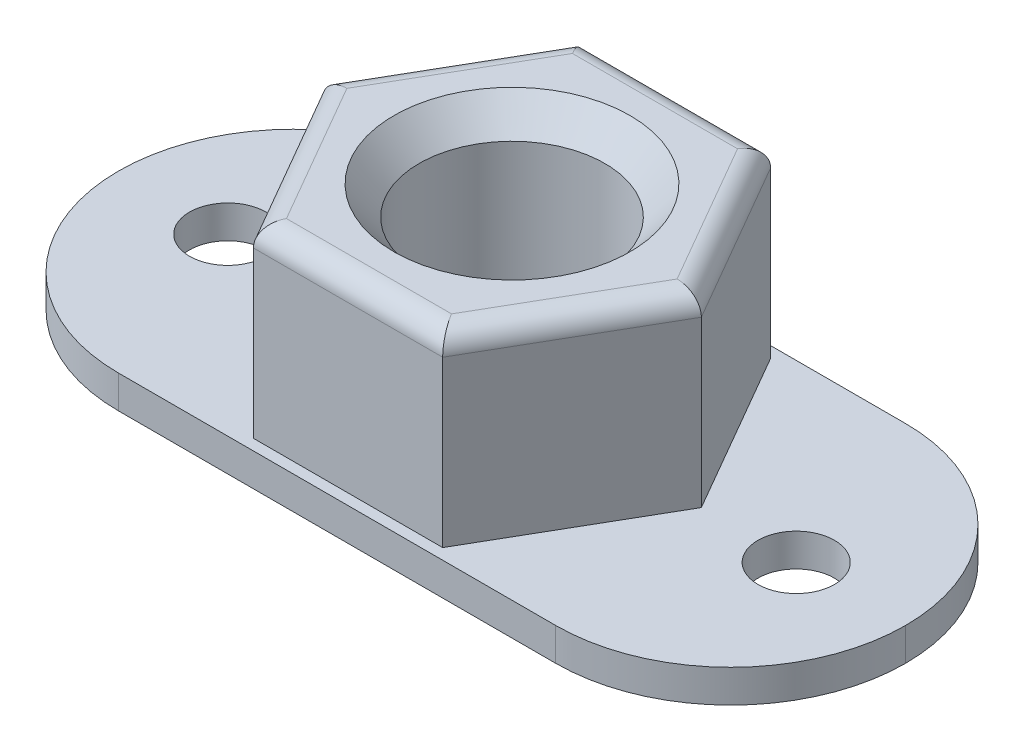
ISO-10303-21;
HEADER;
FILE_DESCRIPTION(('STEP AP214'),'2;1');
FILE_NAME('part.step','',(''),(''),'','','');
FILE_SCHEMA(('AUTOMOTIVE_DESIGN { 1 0 10303 214 1 1 1 1 }'));
ENDSEC;
DATA;
#1=APPLICATION_CONTEXT('core data for automotive mechanical design processes');
#2=APPLICATION_PROTOCOL_DEFINITION('international standard','automotive_design',2000,#1);
#3=PRODUCT_CONTEXT('',#1,'mechanical');
#4=PRODUCT('Part','Part','',(#3));
#5=PRODUCT_RELATED_PRODUCT_CATEGORY('part','',(#4));
#6=PRODUCT_DEFINITION_FORMATION('','',#4);
#7=PRODUCT_DEFINITION_CONTEXT('part definition',#1,'design');
#8=PRODUCT_DEFINITION('design','',#6,#7);
#9=PRODUCT_DEFINITION_SHAPE('','',#8);
#10=(LENGTH_UNIT() NAMED_UNIT(*) SI_UNIT(.MILLI.,.METRE.));
#11=(NAMED_UNIT(*) PLANE_ANGLE_UNIT() SI_UNIT($,.RADIAN.));
#12=(NAMED_UNIT(*) SI_UNIT($,.STERADIAN.) SOLID_ANGLE_UNIT());
#13=UNCERTAINTY_MEASURE_WITH_UNIT(LENGTH_MEASURE(1.E-05),#10,'distance_accuracy_value','');
#14=(GEOMETRIC_REPRESENTATION_CONTEXT(3) GLOBAL_UNCERTAINTY_ASSIGNED_CONTEXT((#13)) GLOBAL_UNIT_ASSIGNED_CONTEXT((#10,
#11,#12)) REPRESENTATION_CONTEXT('',''));
#15=CARTESIAN_POINT('',(0.,0.,0.));
#16=DIRECTION('',(0.,0.,1.));
#17=DIRECTION('',(1.,0.,0.));
#18=AXIS2_PLACEMENT_3D('',#15,#16,#17);
#19=CARTESIAN_POINT('',(6.87407664253899,13.49375,11.90625));
#20=DIRECTION('',(-0.866025403784438,0.,-0.5));
#21=DIRECTION('',(-0.5,0.,0.866025403784439));
#22=AXIS2_PLACEMENT_3D('',#19,#20,#21);
#23=PLANE('',#22);
#24=DIRECTION('',(0.,-1.,0.));
#25=VECTOR('',#24,1.);
#26=CARTESIAN_POINT('',(13.748153285078,13.49375,0.));
#27=LINE('',#26,#25);
#28=CARTESIAN_POINT('',(13.748153285078,11.96975,0.));
#29=VERTEX_POINT('',#28);
#30=CARTESIAN_POINT('',(13.748153285078,0.,0.));
#31=VERTEX_POINT('',#30);
#32=EDGE_CURVE('E156',#29,#31,#27,.T.);
#33=ORIENTED_EDGE('',*,*,#32,.F.);
#34=DIRECTION('',(0.5,0.,-0.866025403784439));
#35=VECTOR('',#34,1.);
#36=CARTESIAN_POINT('',(6.87407664253899,11.96975,11.90625));
#37=LINE('',#36,#35);
#38=CARTESIAN_POINT('',(6.87407664253899,11.96975,11.90625));
#39=VERTEX_POINT('',#38);
#40=EDGE_CURVE('E212',#29,#39,#37,.F.);
#41=ORIENTED_EDGE('',*,*,#40,.T.);
#42=DIRECTION('',(0.,-1.,0.));
#43=VECTOR('',#42,1.);
#44=CARTESIAN_POINT('',(6.87407664253899,13.49375,11.90625));
#45=LINE('',#44,#43);
#46=CARTESIAN_POINT('',(6.87407664253899,0.,11.90625));
#47=VERTEX_POINT('',#46);
#48=EDGE_CURVE('E166',#39,#47,#45,.T.);
#49=ORIENTED_EDGE('',*,*,#48,.T.);
#50=DIRECTION('',(0.5,0.,-0.866025403784438));
#51=VECTOR('',#50,1.);
#52=CARTESIAN_POINT('',(6.87407664253899,0.,11.90625));
#53=LINE('',#52,#51);
#54=EDGE_CURVE('E147',#47,#31,#53,.T.);
#55=ORIENTED_EDGE('',*,*,#54,.T.);
#56=EDGE_LOOP('',(#33,#41,#49,#55));
#57=FACE_BOUND('',#56,.T.);
#58=ADVANCED_FACE('F35',(#57),#23,.F.);
#59=CARTESIAN_POINT('',(13.748153285078,13.49375,0.));
#60=DIRECTION('',(-0.866025403784438,0.,0.5));
#61=DIRECTION('',(0.5,0.,0.866025403784439));
#62=AXIS2_PLACEMENT_3D('',#59,#60,#61);
#63=PLANE('',#62);
#64=DIRECTION('',(0.,-1.,0.));
#65=VECTOR('',#64,1.);
#66=CARTESIAN_POINT('',(6.87407664253898,13.49375,-11.90625));
#67=LINE('',#66,#65);
#68=CARTESIAN_POINT('',(6.87407664253898,11.96975,-11.90625));
#69=VERTEX_POINT('',#68);
#70=CARTESIAN_POINT('',(6.87407664253898,0.,-11.90625));
#71=VERTEX_POINT('',#70);
#72=EDGE_CURVE('E163',#69,#71,#67,.T.);
#73=ORIENTED_EDGE('',*,*,#72,.F.);
#74=DIRECTION('',(-0.5,0.,-0.866025403784439));
#75=VECTOR('',#74,1.);
#76=CARTESIAN_POINT('',(13.748153285078,11.96975,0.));
#77=LINE('',#76,#75);
#78=EDGE_CURVE('E159',#69,#29,#77,.F.);
#79=ORIENTED_EDGE('',*,*,#78,.T.);
#80=ORIENTED_EDGE('',*,*,#32,.T.);
#81=DIRECTION('',(-0.5,0.,-0.866025403784439));
#82=VECTOR('',#81,1.);
#83=CARTESIAN_POINT('',(13.748153285078,0.,0.));
#84=LINE('',#83,#82);
#85=EDGE_CURVE('E143',#31,#71,#84,.T.);
#86=ORIENTED_EDGE('',*,*,#85,.T.);
#87=EDGE_LOOP('',(#73,#79,#80,#86));
#88=FACE_BOUND('',#87,.T.);
#89=ADVANCED_FACE('F157',(#88),#63,.F.);
#90=CARTESIAN_POINT('',(6.87407664253898,13.49375,-11.90625));
#91=DIRECTION('',(0.,0.,1.));
#92=DIRECTION('',(1.,0.,0.));
#93=AXIS2_PLACEMENT_3D('',#90,#91,#92);
#94=PLANE('',#93);
#95=DIRECTION('',(0.,-1.,0.));
#96=VECTOR('',#95,1.);
#97=CARTESIAN_POINT('',(-6.87407664253898,13.49375,-11.90625));
#98=LINE('',#97,#96);
#99=CARTESIAN_POINT('',(-6.87407664253898,11.96975,-11.90625));
#100=VERTEX_POINT('',#99);
#101=CARTESIAN_POINT('',(-6.87407664253898,0.,-11.90625));
#102=VERTEX_POINT('',#101);
#103=EDGE_CURVE('E192',#100,#102,#98,.T.);
#104=ORIENTED_EDGE('',*,*,#103,.F.);
#105=DIRECTION('',(-1.,0.,0.));
#106=VECTOR('',#105,1.);
#107=CARTESIAN_POINT('',(6.87407664253898,11.96975,-11.90625));
#108=LINE('',#107,#106);
#109=EDGE_CURVE('E208',#100,#69,#108,.F.);
#110=ORIENTED_EDGE('',*,*,#109,.T.);
#111=ORIENTED_EDGE('',*,*,#72,.T.);
#112=DIRECTION('',(-1.,0.,0.));
#113=VECTOR('',#112,1.);
#114=CARTESIAN_POINT('',(6.87407664253898,0.,-11.90625));
#115=LINE('',#114,#113);
#116=EDGE_CURVE('E150',#71,#102,#115,.T.);
#117=ORIENTED_EDGE('',*,*,#116,.T.);
#118=EDGE_LOOP('',(#104,#110,#111,#117));
#119=FACE_BOUND('',#118,.T.);
#120=ADVANCED_FACE('F318',(#119),#94,.F.);
#121=CARTESIAN_POINT('',(-6.87407664253898,13.49375,-11.90625));
#122=DIRECTION('',(0.866025403784439,0.,0.5));
#123=DIRECTION('',(0.5,0.,-0.866025403784439));
#124=AXIS2_PLACEMENT_3D('',#121,#122,#123);
#125=PLANE('',#124);
#126=DIRECTION('',(0.,-1.,0.));
#127=VECTOR('',#126,1.);
#128=CARTESIAN_POINT('',(-13.748153285078,13.49375,0.));
#129=LINE('',#128,#127);
#130=CARTESIAN_POINT('',(-13.748153285078,11.96975,0.));
#131=VERTEX_POINT('',#130);
#132=CARTESIAN_POINT('',(-13.748153285078,0.,0.));
#133=VERTEX_POINT('',#132);
#134=EDGE_CURVE('E189',#131,#133,#129,.T.);
#135=ORIENTED_EDGE('',*,*,#134,.F.);
#136=DIRECTION('',(-0.5,0.,0.866025403784439));
#137=VECTOR('',#136,1.);
#138=CARTESIAN_POINT('',(-6.87407664253898,11.96975,-11.90625));
#139=LINE('',#138,#137);
#140=EDGE_CURVE('E218',#131,#100,#139,.F.);
#141=ORIENTED_EDGE('',*,*,#140,.T.);
#142=ORIENTED_EDGE('',*,*,#103,.T.);
#143=DIRECTION('',(-0.5,0.,0.866025403784439));
#144=VECTOR('',#143,1.);
#145=CARTESIAN_POINT('',(-6.87407664253898,0.,-11.90625));
#146=LINE('',#145,#144);
#147=EDGE_CURVE('E177',#102,#133,#146,.T.);
#148=ORIENTED_EDGE('',*,*,#147,.T.);
#149=EDGE_LOOP('',(#135,#141,#142,#148));
#150=FACE_BOUND('',#149,.T.);
#151=ADVANCED_FACE('F528',(#150),#125,.F.);
#152=CARTESIAN_POINT('',(-13.748153285078,13.49375,0.));
#153=DIRECTION('',(0.866025403784438,0.,-0.5));
#154=DIRECTION('',(-0.5,0.,-0.866025403784438));
#155=AXIS2_PLACEMENT_3D('',#152,#153,#154);
#156=PLANE('',#155);
#157=DIRECTION('',(0.,-1.,0.));
#158=VECTOR('',#157,1.);
#159=CARTESIAN_POINT('',(-6.87407664253898,13.49375,11.90625));
#160=LINE('',#159,#158);
#161=CARTESIAN_POINT('',(-6.87407664253898,11.96975,11.90625));
#162=VERTEX_POINT('',#161);
#163=CARTESIAN_POINT('',(-6.87407664253898,0.,11.90625));
#164=VERTEX_POINT('',#163);
#165=EDGE_CURVE('E186',#162,#164,#160,.T.);
#166=ORIENTED_EDGE('',*,*,#165,.F.);
#167=DIRECTION('',(0.5,0.,0.866025403784438));
#168=VECTOR('',#167,1.);
#169=CARTESIAN_POINT('',(-13.748153285078,11.96975,0.));
#170=LINE('',#169,#168);
#171=EDGE_CURVE('E216',#162,#131,#170,.F.);
#172=ORIENTED_EDGE('',*,*,#171,.T.);
#173=ORIENTED_EDGE('',*,*,#134,.T.);
#174=DIRECTION('',(0.5,0.,0.866025403784438));
#175=VECTOR('',#174,1.);
#176=CARTESIAN_POINT('',(-13.748153285078,0.,0.));
#177=LINE('',#176,#175);
#178=EDGE_CURVE('E180',#133,#164,#177,.T.);
#179=ORIENTED_EDGE('',*,*,#178,.T.);
#180=EDGE_LOOP('',(#166,#172,#173,#179));
#181=FACE_BOUND('',#180,.T.);
#182=ADVANCED_FACE('F310',(#181),#156,.F.);
#183=CARTESIAN_POINT('',(-6.87407664253898,13.49375,11.90625));
#184=DIRECTION('',(0.,0.,-1.));
#185=DIRECTION('',(-1.,0.,0.));
#186=AXIS2_PLACEMENT_3D('',#183,#184,#185);
#187=PLANE('',#186);
#188=ORIENTED_EDGE('',*,*,#48,.F.);
#189=DIRECTION('',(1.,0.,0.));
#190=VECTOR('',#189,1.);
#191=CARTESIAN_POINT('',(-6.87407664253898,11.96975,11.90625));
#192=LINE('',#191,#190);
#193=EDGE_CURVE('E214',#39,#162,#192,.F.);
#194=ORIENTED_EDGE('',*,*,#193,.T.);
#195=ORIENTED_EDGE('',*,*,#165,.T.);
#196=DIRECTION('',(1.,0.,0.));
#197=VECTOR('',#196,1.);
#198=CARTESIAN_POINT('',(-6.87407664253898,0.,11.90625));
#199=LINE('',#198,#197);
#200=EDGE_CURVE('E183',#164,#47,#199,.T.);
#201=ORIENTED_EDGE('',*,*,#200,.T.);
#202=EDGE_LOOP('',(#188,#194,#195,#201));
#203=FACE_BOUND('',#202,.T.);
#204=ADVANCED_FACE('F301',(#203),#187,.F.);
#205=CARTESIAN_POINT('',(0.,13.49375,0.));
#206=DIRECTION('',(0.,1.,0.));
#207=DIRECTION('',(0.,0.,1.));
#208=AXIS2_PLACEMENT_3D('',#205,#206,#207);
#209=PLANE('',#208);
#210=DIRECTION('',(-0.5,0.,-0.866025403784439));
#211=VECTOR('',#210,1.);
#212=CARTESIAN_POINT('',(5.5542539271715,13.49375,-11.14425));
#213=LINE('',#212,#211);
#214=CARTESIAN_POINT('',(11.988389664588,13.49375,0.));
#215=VERTEX_POINT('',#214);
#216=CARTESIAN_POINT('',(5.99419483229399,13.49375,-10.38225));
#217=VERTEX_POINT('',#216);
#218=EDGE_CURVE('E203',#215,#217,#213,.T.);
#219=ORIENTED_EDGE('',*,*,#218,.T.);
#220=DIRECTION('',(-1.,0.,0.));
#221=VECTOR('',#220,1.);
#222=CARTESIAN_POINT('',(-6.87407664253898,13.49375,-10.38225));
#223=LINE('',#222,#221);
#224=CARTESIAN_POINT('',(-5.99419483229399,13.49375,-10.38225));
#225=VERTEX_POINT('',#224);
#226=EDGE_CURVE('E205',#217,#225,#223,.T.);
#227=ORIENTED_EDGE('',*,*,#226,.T.);
#228=DIRECTION('',(-0.5,0.,0.866025403784439));
#229=VECTOR('',#228,1.);
#230=CARTESIAN_POINT('',(-12.4283305697105,13.49375,0.761999999999997));
#231=LINE('',#230,#229);
#232=CARTESIAN_POINT('',(-11.988389664588,13.49375,0.));
#233=VERTEX_POINT('',#232);
#234=EDGE_CURVE('E162',#225,#233,#231,.T.);
#235=ORIENTED_EDGE('',*,*,#234,.T.);
#236=DIRECTION('',(0.5,0.,0.866025403784438));
#237=VECTOR('',#236,1.);
#238=CARTESIAN_POINT('',(-5.55425392717149,13.49375,11.14425));
#239=LINE('',#238,#237);
#240=CARTESIAN_POINT('',(-5.99419483229399,13.49375,10.38225));
#241=VERTEX_POINT('',#240);
#242=EDGE_CURVE('E197',#233,#241,#239,.T.);
#243=ORIENTED_EDGE('',*,*,#242,.T.);
#244=DIRECTION('',(1.,0.,0.));
#245=VECTOR('',#244,1.);
#246=CARTESIAN_POINT('',(6.87407664253899,13.49375,10.38225));
#247=LINE('',#246,#245);
#248=CARTESIAN_POINT('',(5.994194832294,13.49375,10.38225));
#249=VERTEX_POINT('',#248);
#250=EDGE_CURVE('E199',#241,#249,#247,.T.);
#251=ORIENTED_EDGE('',*,*,#250,.T.);
#252=DIRECTION('',(0.5,0.,-0.866025403784439));
#253=VECTOR('',#252,1.);
#254=CARTESIAN_POINT('',(12.4283305697105,13.49375,-0.761999999999999));
#255=LINE('',#254,#253);
#256=EDGE_CURVE('E201',#249,#215,#255,.T.);
#257=ORIENTED_EDGE('',*,*,#256,.T.);
#258=EDGE_LOOP('',(#219,#227,#235,#243,#251,#257));
#259=FACE_BOUND('',#258,.T.);
#260=CARTESIAN_POINT('',(0.,13.49375,0.));
#261=DIRECTION('',(0.,1.,0.));
#262=DIRECTION('',(0.,0.,1.));
#263=AXIS2_PLACEMENT_3D('',#260,#261,#262);
#264=CIRCLE('',#263,8.5725);
#265=CARTESIAN_POINT('',(0.,13.49375,8.5725));
#266=VERTEX_POINT('',#265);
#267=EDGE_CURVE('E171',#266,#266,#264,.T.);
#268=ORIENTED_EDGE('',*,*,#267,.F.);
#269=EDGE_LOOP('',(#268));
#270=FACE_BOUND('',#269,.T.);
#271=ADVANCED_FACE('F298',(#259,#270),#209,.T.);
#272=CARTESIAN_POINT('',(0.,13.49375,0.));
#273=DIRECTION('',(0.,1.,0.));
#274=DIRECTION('',(0.,0.,1.));
#275=AXIS2_PLACEMENT_3D('',#272,#273,#274);
#276=CYLINDRICAL_SURFACE('',#275,6.74624);
#277=CARTESIAN_POINT('',(0.,0.,0.));
#278=DIRECTION('',(0.,1.,0.));
#279=DIRECTION('',(0.,0.,1.));
#280=AXIS2_PLACEMENT_3D('',#277,#278,#279);
#281=CIRCLE('',#280,6.74623999999999);
#282=CARTESIAN_POINT('',(0.,0.,6.74623999999999));
#283=VERTEX_POINT('',#282);
#284=EDGE_CURVE('E174',#283,#283,#281,.T.);
#285=ORIENTED_EDGE('',*,*,#284,.F.);
#286=EDGE_LOOP('',(#285));
#287=FACE_BOUND('',#286,.T.);
#288=CARTESIAN_POINT('',(0.,11.3928781926286,0.));
#289=DIRECTION('',(0.,1.,0.));
#290=DIRECTION('',(0.,0.,1.));
#291=AXIS2_PLACEMENT_3D('',#288,#289,#290);
#292=CIRCLE('',#291,6.74624);
#293=CARTESIAN_POINT('',(0.,11.3928781926286,6.74624));
#294=VERTEX_POINT('',#293);
#295=EDGE_CURVE('E168',#294,#294,#292,.T.);
#296=ORIENTED_EDGE('',*,*,#295,.T.);
#297=EDGE_LOOP('',(#296));
#298=FACE_BOUND('',#297,.T.);
#299=ADVANCED_FACE('F300',(#287,#298),#276,.F.);
#300=CARTESIAN_POINT('',(0.,13.49375,0.));
#301=DIRECTION('',(0.,1.,0.));
#302=DIRECTION('',(0.,0.,1.));
#303=AXIS2_PLACEMENT_3D('',#300,#301,#302);
#304=CONICAL_SURFACE('',#303,8.5725,0.715584993317675);
#305=ORIENTED_EDGE('',*,*,#295,.F.);
#306=EDGE_LOOP('',(#305));
#307=FACE_BOUND('',#306,.T.);
#308=ORIENTED_EDGE('',*,*,#267,.T.);
#309=EDGE_LOOP('',(#308));
#310=FACE_BOUND('',#309,.T.);
#311=ADVANCED_FACE('F296',(#307,#310),#304,.F.);
#312=CARTESIAN_POINT('',(0.,11.96975,10.38225));
#313=DIRECTION('',(-1.,0.,0.));
#314=DIRECTION('',(0.,0.,1.));
#315=AXIS2_PLACEMENT_3D('',#312,#313,#314);
#316=CYLINDRICAL_SURFACE('',#315,1.524);
#317=CARTESIAN_POINT('',(-5.99419483229399,11.96975,10.38225));
#318=DIRECTION('',(-0.866025403784439,0.,-0.5));
#319=DIRECTION('',(0.5,0.,-0.866025403784439));
#320=AXIS2_PLACEMENT_3D('',#317,#318,#319);
#321=ELLIPSE('',#320,1.75976362048998,1.524);
#322=EDGE_CURVE('E232',#162,#241,#321,.T.);
#323=ORIENTED_EDGE('',*,*,#322,.F.);
#324=ORIENTED_EDGE('',*,*,#193,.F.);
#325=CARTESIAN_POINT('',(5.994194832294,11.96975,10.38225));
#326=DIRECTION('',(-0.866025403784439,0.,0.5));
#327=DIRECTION('',(-0.5,0.,-0.866025403784439));
#328=AXIS2_PLACEMENT_3D('',#325,#326,#327);
#329=ELLIPSE('',#328,1.75976362048998,1.524);
#330=EDGE_CURVE('E235',#249,#39,#329,.F.);
#331=ORIENTED_EDGE('',*,*,#330,.F.);
#332=ORIENTED_EDGE('',*,*,#250,.F.);
#333=EDGE_LOOP('',(#323,#324,#331,#332));
#334=FACE_BOUND('',#333,.T.);
#335=ADVANCED_FACE('F342',(#334),#316,.T.);
#336=CARTESIAN_POINT('',(8.99129224844099,11.96975,5.191125));
#337=DIRECTION('',(-0.5,0.,0.866025403784439));
#338=DIRECTION('',(0.866025403784439,0.,0.5));
#339=AXIS2_PLACEMENT_3D('',#336,#337,#338);
#340=CYLINDRICAL_SURFACE('',#339,1.524);
#341=ORIENTED_EDGE('',*,*,#330,.T.);
#342=ORIENTED_EDGE('',*,*,#40,.F.);
#343=CARTESIAN_POINT('',(11.988389664588,11.96975,0.));
#344=DIRECTION('',(0.,0.,1.));
#345=DIRECTION('',(-1.,0.,0.));
#346=AXIS2_PLACEMENT_3D('',#343,#344,#345);
#347=ELLIPSE('',#346,1.75976362048998,1.524);
#348=EDGE_CURVE('E229',#215,#29,#347,.F.);
#349=ORIENTED_EDGE('',*,*,#348,.F.);
#350=ORIENTED_EDGE('',*,*,#256,.F.);
#351=EDGE_LOOP('',(#341,#342,#349,#350));
#352=FACE_BOUND('',#351,.T.);
#353=ADVANCED_FACE('F338',(#352),#340,.T.);
#354=CARTESIAN_POINT('',(-8.99129224844098,11.96975,5.191125));
#355=DIRECTION('',(-0.5,0.,-0.866025403784438));
#356=DIRECTION('',(-0.866025403784438,0.,0.5));
#357=AXIS2_PLACEMENT_3D('',#354,#355,#356);
#358=CYLINDRICAL_SURFACE('',#357,1.524);
#359=ORIENTED_EDGE('',*,*,#322,.T.);
#360=ORIENTED_EDGE('',*,*,#242,.F.);
#361=CARTESIAN_POINT('',(-11.988389664588,11.96975,0.));
#362=DIRECTION('',(0.,0.,-1.));
#363=DIRECTION('',(1.,0.,0.));
#364=AXIS2_PLACEMENT_3D('',#361,#362,#363);
#365=ELLIPSE('',#364,1.75976362048998,1.524);
#366=EDGE_CURVE('E226',#131,#233,#365,.T.);
#367=ORIENTED_EDGE('',*,*,#366,.F.);
#368=ORIENTED_EDGE('',*,*,#171,.F.);
#369=EDGE_LOOP('',(#359,#360,#367,#368));
#370=FACE_BOUND('',#369,.T.);
#371=ADVANCED_FACE('F334',(#370),#358,.T.);
#372=CARTESIAN_POINT('',(8.99129224844099,11.96975,-5.191125));
#373=DIRECTION('',(0.5,0.,0.866025403784439));
#374=DIRECTION('',(0.866025403784438,0.,-0.5));
#375=AXIS2_PLACEMENT_3D('',#372,#373,#374);
#376=CYLINDRICAL_SURFACE('',#375,1.524);
#377=ORIENTED_EDGE('',*,*,#348,.T.);
#378=ORIENTED_EDGE('',*,*,#78,.F.);
#379=CARTESIAN_POINT('',(5.99419483229399,11.96975,-10.38225));
#380=DIRECTION('',(0.866025403784439,0.,0.5));
#381=DIRECTION('',(-0.5,0.,0.866025403784439));
#382=AXIS2_PLACEMENT_3D('',#379,#380,#381);
#383=ELLIPSE('',#382,1.75976362048998,1.524);
#384=EDGE_CURVE('E223',#217,#69,#383,.F.);
#385=ORIENTED_EDGE('',*,*,#384,.F.);
#386=ORIENTED_EDGE('',*,*,#218,.F.);
#387=EDGE_LOOP('',(#377,#378,#385,#386));
#388=FACE_BOUND('',#387,.T.);
#389=ADVANCED_FACE('F330',(#388),#376,.T.);
#390=CARTESIAN_POINT('',(-8.99129224844099,11.96975,-5.191125));
#391=DIRECTION('',(0.5,0.,-0.866025403784439));
#392=DIRECTION('',(-0.866025403784439,0.,-0.5));
#393=AXIS2_PLACEMENT_3D('',#390,#391,#392);
#394=CYLINDRICAL_SURFACE('',#393,1.524);
#395=ORIENTED_EDGE('',*,*,#366,.T.);
#396=ORIENTED_EDGE('',*,*,#234,.F.);
#397=CARTESIAN_POINT('',(-5.99419483229399,11.96975,-10.38225));
#398=DIRECTION('',(0.866025403784439,0.,-0.5));
#399=DIRECTION('',(-0.5,0.,-0.866025403784439));
#400=AXIS2_PLACEMENT_3D('',#397,#398,#399);
#401=ELLIPSE('',#400,1.75976362048998,1.524);
#402=EDGE_CURVE('E221',#100,#225,#401,.T.);
#403=ORIENTED_EDGE('',*,*,#402,.F.);
#404=ORIENTED_EDGE('',*,*,#140,.F.);
#405=EDGE_LOOP('',(#395,#396,#403,#404));
#406=FACE_BOUND('',#405,.T.);
#407=ADVANCED_FACE('F326',(#406),#394,.T.);
#408=CARTESIAN_POINT('',(0.,11.96975,-10.38225));
#409=DIRECTION('',(1.,0.,0.));
#410=DIRECTION('',(0.,0.,-1.));
#411=AXIS2_PLACEMENT_3D('',#408,#409,#410);
#412=CYLINDRICAL_SURFACE('',#411,1.524);
#413=ORIENTED_EDGE('',*,*,#384,.T.);
#414=ORIENTED_EDGE('',*,*,#109,.F.);
#415=ORIENTED_EDGE('',*,*,#402,.T.);
#416=ORIENTED_EDGE('',*,*,#226,.F.);
#417=EDGE_LOOP('',(#413,#414,#415,#416));
#418=FACE_BOUND('',#417,.T.);
#419=ADVANCED_FACE('F322',(#418),#412,.T.);
#420=CARTESIAN_POINT('',(0.,-2.38125,0.));
#421=DIRECTION('',(0.,1.,0.));
#422=DIRECTION('',(0.,0.,1.));
#423=AXIS2_PLACEMENT_3D('',#420,#421,#422);
#424=PLANE('',#423);
#425=CARTESIAN_POINT('',(-20.6375,-2.38125,0.));
#426=DIRECTION('',(0.,-1.,0.));
#427=DIRECTION('',(0.,0.,-1.));
#428=AXIS2_PLACEMENT_3D('',#425,#426,#427);
#429=CIRCLE('',#428,2.778125);
#430=CARTESIAN_POINT('',(-20.6375,-2.38125,-2.778125));
#431=VERTEX_POINT('',#430);
#432=EDGE_CURVE('E267',#431,#431,#429,.T.);
#433=ORIENTED_EDGE('',*,*,#432,.F.);
#434=EDGE_LOOP('',(#433));
#435=FACE_BOUND('',#434,.T.);
#436=CARTESIAN_POINT('',(20.6375,-2.38125,0.));
#437=DIRECTION('',(0.,-1.,0.));
#438=DIRECTION('',(0.,0.,-1.));
#439=AXIS2_PLACEMENT_3D('',#436,#437,#438);
#440=CIRCLE('',#439,2.778125);
#441=CARTESIAN_POINT('',(20.6375,-2.38125,-2.778125));
#442=VERTEX_POINT('',#441);
#443=EDGE_CURVE('E273',#442,#442,#440,.T.);
#444=ORIENTED_EDGE('',*,*,#443,.F.);
#445=EDGE_LOOP('',(#444));
#446=FACE_BOUND('',#445,.T.);
#447=CARTESIAN_POINT('',(0.,-2.38125,0.));
#448=DIRECTION('',(0.,-1.,0.));
#449=DIRECTION('',(0.,0.,-1.));
#450=AXIS2_PLACEMENT_3D('',#447,#448,#449);
#451=CIRCLE('',#450,9.525);
#452=CARTESIAN_POINT('',(0.,-2.38125,-9.525));
#453=VERTEX_POINT('',#452);
#454=EDGE_CURVE('E271',#453,#453,#451,.T.);
#455=ORIENTED_EDGE('',*,*,#454,.F.);
#456=EDGE_LOOP('',(#455));
#457=FACE_BOUND('',#456,.T.);
#458=CARTESIAN_POINT('',(-15.875,-2.38125,0.));
#459=DIRECTION('',(0.,1.,0.));
#460=DIRECTION('',(0.,0.,1.));
#461=AXIS2_PLACEMENT_3D('',#458,#459,#460);
#462=CIRCLE('',#461,12.7);
#463=CARTESIAN_POINT('',(-15.875,-2.38125,12.7));
#464=VERTEX_POINT('',#463);
#465=CARTESIAN_POINT('',(-28.575,-2.38125,0.));
#466=VERTEX_POINT('',#465);
#467=EDGE_CURVE('E52',#464,#466,#462,.F.);
#468=ORIENTED_EDGE('',*,*,#467,.T.);
#469=CARTESIAN_POINT('',(-15.875,-2.38125,0.));
#470=DIRECTION('',(0.,1.,0.));
#471=DIRECTION('',(0.,0.,1.));
#472=AXIS2_PLACEMENT_3D('',#469,#470,#471);
#473=CIRCLE('',#472,12.7);
#474=CARTESIAN_POINT('',(-15.875,-2.38125,-12.7));
#475=VERTEX_POINT('',#474);
#476=EDGE_CURVE('E256',#466,#475,#473,.F.);
#477=ORIENTED_EDGE('',*,*,#476,.T.);
#478=DIRECTION('',(1.,0.,0.));
#479=VECTOR('',#478,1.);
#480=CARTESIAN_POINT('',(-28.575,-2.38125,-12.7));
#481=LINE('',#480,#479);
#482=CARTESIAN_POINT('',(15.875,-2.38125,-12.7));
#483=VERTEX_POINT('',#482);
#484=EDGE_CURVE('E224',#475,#483,#481,.T.);
#485=ORIENTED_EDGE('',*,*,#484,.T.);
#486=CARTESIAN_POINT('',(15.875,-2.38125,0.));
#487=DIRECTION('',(0.,1.,0.));
#488=DIRECTION('',(0.,0.,1.));
#489=AXIS2_PLACEMENT_3D('',#486,#487,#488);
#490=CIRCLE('',#489,12.7);
#491=CARTESIAN_POINT('',(28.575,-2.38125,0.));
#492=VERTEX_POINT('',#491);
#493=EDGE_CURVE('E253',#483,#492,#490,.F.);
#494=ORIENTED_EDGE('',*,*,#493,.T.);
#495=CARTESIAN_POINT('',(15.875,-2.38125,0.));
#496=DIRECTION('',(0.,1.,0.));
#497=DIRECTION('',(0.,0.,1.));
#498=AXIS2_PLACEMENT_3D('',#495,#496,#497);
#499=CIRCLE('',#498,12.7);
#500=CARTESIAN_POINT('',(15.875,-2.38125,12.7));
#501=VERTEX_POINT('',#500);
#502=EDGE_CURVE('E251',#492,#501,#499,.F.);
#503=ORIENTED_EDGE('',*,*,#502,.T.);
#504=DIRECTION('',(-1.,0.,0.));
#505=VECTOR('',#504,1.);
#506=CARTESIAN_POINT('',(-28.575,-2.38125,12.7));
#507=LINE('',#506,#505);
#508=EDGE_CURVE('E285',#501,#464,#507,.T.);
#509=ORIENTED_EDGE('',*,*,#508,.T.);
#510=EDGE_LOOP('',(#468,#477,#485,#494,#503,#509));
#511=FACE_BOUND('',#510,.T.);
#512=ADVANCED_FACE('F325',(#435,#446,#457,#511),#424,.F.);
#513=CARTESIAN_POINT('',(-28.575,-2.38125,-12.7));
#514=DIRECTION('',(0.,0.,1.));
#515=DIRECTION('',(1.,0.,0.));
#516=AXIS2_PLACEMENT_3D('',#513,#514,#515);
#517=PLANE('',#516);
#518=ORIENTED_EDGE('',*,*,#484,.F.);
#519=DIRECTION('',(0.,1.,0.));
#520=VECTOR('',#519,1.);
#521=CARTESIAN_POINT('',(-15.875,-2.38125,-12.7));
#522=LINE('',#521,#520);
#523=CARTESIAN_POINT('',(-15.875,0.,-12.7));
#524=VERTEX_POINT('',#523);
#525=EDGE_CURVE('E240',#475,#524,#522,.T.);
#526=ORIENTED_EDGE('',*,*,#525,.T.);
#527=DIRECTION('',(1.,0.,0.));
#528=VECTOR('',#527,1.);
#529=CARTESIAN_POINT('',(-28.575,0.,-12.7));
#530=LINE('',#529,#528);
#531=CARTESIAN_POINT('',(15.875,0.,-12.7));
#532=VERTEX_POINT('',#531);
#533=EDGE_CURVE('E287',#524,#532,#530,.T.);
#534=ORIENTED_EDGE('',*,*,#533,.T.);
#535=DIRECTION('',(0.,1.,0.));
#536=VECTOR('',#535,1.);
#537=CARTESIAN_POINT('',(15.875,-2.38125,-12.7));
#538=LINE('',#537,#536);
#539=EDGE_CURVE('E220',#532,#483,#538,.F.);
#540=ORIENTED_EDGE('',*,*,#539,.T.);
#541=EDGE_LOOP('',(#518,#526,#534,#540));
#542=FACE_BOUND('',#541,.T.);
#543=ADVANCED_FACE('F372',(#542),#517,.F.);
#544=CARTESIAN_POINT('',(-28.575,-2.38125,12.7));
#545=DIRECTION('',(0.,0.,-1.));
#546=DIRECTION('',(-1.,0.,0.));
#547=AXIS2_PLACEMENT_3D('',#544,#545,#546);
#548=PLANE('',#547);
#549=DIRECTION('',(-1.,0.,0.));
#550=VECTOR('',#549,1.);
#551=CARTESIAN_POINT('',(-28.575,0.,12.7));
#552=LINE('',#551,#550);
#553=CARTESIAN_POINT('',(15.875,0.,12.7));
#554=VERTEX_POINT('',#553);
#555=CARTESIAN_POINT('',(-15.875,0.,12.7));
#556=VERTEX_POINT('',#555);
#557=EDGE_CURVE('E262',#554,#556,#552,.T.);
#558=ORIENTED_EDGE('',*,*,#557,.T.);
#559=DIRECTION('',(0.,1.,0.));
#560=VECTOR('',#559,1.);
#561=CARTESIAN_POINT('',(-15.875,-2.38125,12.7));
#562=LINE('',#561,#560);
#563=EDGE_CURVE('E11',#556,#464,#562,.F.);
#564=ORIENTED_EDGE('',*,*,#563,.T.);
#565=ORIENTED_EDGE('',*,*,#508,.F.);
#566=DIRECTION('',(0.,1.,0.));
#567=VECTOR('',#566,1.);
#568=CARTESIAN_POINT('',(15.875,-2.38125,12.7));
#569=LINE('',#568,#567);
#570=EDGE_CURVE('E44',#501,#554,#569,.T.);
#571=ORIENTED_EDGE('',*,*,#570,.T.);
#572=EDGE_LOOP('',(#558,#564,#565,#571));
#573=FACE_BOUND('',#572,.T.);
#574=ADVANCED_FACE('F381',(#573),#548,.F.);
#575=CARTESIAN_POINT('',(0.,0.,0.));
#576=DIRECTION('',(0.,1.,0.));
#577=DIRECTION('',(0.,0.,1.));
#578=AXIS2_PLACEMENT_3D('',#575,#576,#577);
#579=PLANE('',#578);
#580=CARTESIAN_POINT('',(-20.6375,0.,0.));
#581=DIRECTION('',(0.,1.,0.));
#582=DIRECTION('',(0.,0.,1.));
#583=AXIS2_PLACEMENT_3D('',#580,#581,#582);
#584=CIRCLE('',#583,2.778125);
#585=CARTESIAN_POINT('',(-20.6375,0.,2.778125));
#586=VERTEX_POINT('',#585);
#587=EDGE_CURVE('E39',#586,#586,#584,.T.);
#588=ORIENTED_EDGE('',*,*,#587,.F.);
#589=EDGE_LOOP('',(#588));
#590=FACE_BOUND('',#589,.T.);
#591=CARTESIAN_POINT('',(20.6375,0.,0.));
#592=DIRECTION('',(0.,1.,0.));
#593=DIRECTION('',(0.,0.,1.));
#594=AXIS2_PLACEMENT_3D('',#591,#592,#593);
#595=CIRCLE('',#594,2.778125);
#596=CARTESIAN_POINT('',(20.6375,0.,2.778125));
#597=VERTEX_POINT('',#596);
#598=EDGE_CURVE('E265',#597,#597,#595,.T.);
#599=ORIENTED_EDGE('',*,*,#598,.F.);
#600=EDGE_LOOP('',(#599));
#601=FACE_BOUND('',#600,.T.);
#602=ORIENTED_EDGE('',*,*,#533,.F.);
#603=CARTESIAN_POINT('',(-15.875,0.,0.));
#604=DIRECTION('',(0.,1.,0.));
#605=DIRECTION('',(0.,0.,1.));
#606=AXIS2_PLACEMENT_3D('',#603,#604,#605);
#607=CIRCLE('',#606,12.7);
#608=CARTESIAN_POINT('',(-28.575,0.,0.));
#609=VERTEX_POINT('',#608);
#610=EDGE_CURVE('E249',#524,#609,#607,.T.);
#611=ORIENTED_EDGE('',*,*,#610,.T.);
#612=CARTESIAN_POINT('',(-15.875,0.,0.));
#613=DIRECTION('',(0.,1.,0.));
#614=DIRECTION('',(0.,0.,1.));
#615=AXIS2_PLACEMENT_3D('',#612,#613,#614);
#616=CIRCLE('',#615,12.7);
#617=EDGE_CURVE('E247',#609,#556,#616,.T.);
#618=ORIENTED_EDGE('',*,*,#617,.T.);
#619=ORIENTED_EDGE('',*,*,#557,.F.);
#620=CARTESIAN_POINT('',(15.875,0.,0.));
#621=DIRECTION('',(0.,1.,0.));
#622=DIRECTION('',(0.,0.,1.));
#623=AXIS2_PLACEMENT_3D('',#620,#621,#622);
#624=CIRCLE('',#623,12.7);
#625=CARTESIAN_POINT('',(28.575,0.,0.));
#626=VERTEX_POINT('',#625);
#627=EDGE_CURVE('E243',#554,#626,#624,.T.);
#628=ORIENTED_EDGE('',*,*,#627,.T.);
#629=CARTESIAN_POINT('',(15.875,0.,0.));
#630=DIRECTION('',(0.,1.,0.));
#631=DIRECTION('',(0.,0.,1.));
#632=AXIS2_PLACEMENT_3D('',#629,#630,#631);
#633=CIRCLE('',#632,12.7);
#634=EDGE_CURVE('E245',#626,#532,#633,.T.);
#635=ORIENTED_EDGE('',*,*,#634,.T.);
#636=EDGE_LOOP('',(#602,#611,#618,#619,#628,#635));
#637=FACE_BOUND('',#636,.T.);
#638=ORIENTED_EDGE('',*,*,#54,.F.);
#639=ORIENTED_EDGE('',*,*,#200,.F.);
#640=ORIENTED_EDGE('',*,*,#178,.F.);
#641=ORIENTED_EDGE('',*,*,#147,.F.);
#642=ORIENTED_EDGE('',*,*,#116,.F.);
#643=ORIENTED_EDGE('',*,*,#85,.F.);
#644=EDGE_LOOP('',(#638,#639,#640,#641,#642,#643));
#645=FACE_BOUND('',#644,.T.);
#646=ADVANCED_FACE('F145',(#590,#601,#637,#645),#579,.T.);
#647=CARTESIAN_POINT('',(-15.875,-2.38125,0.));
#648=DIRECTION('',(0.,1.,0.));
#649=DIRECTION('',(0.,0.,1.));
#650=AXIS2_PLACEMENT_3D('',#647,#648,#649);
#651=CYLINDRICAL_SURFACE('',#650,12.7);
#652=DIRECTION('',(0.,1.,0.));
#653=VECTOR('',#652,1.);
#654=CARTESIAN_POINT('',(-28.575,-2.38125,0.));
#655=LINE('',#654,#653);
#656=EDGE_CURVE('E259',#466,#609,#655,.T.);
#657=ORIENTED_EDGE('',*,*,#656,.F.);
#658=ORIENTED_EDGE('',*,*,#467,.F.);
#659=ORIENTED_EDGE('',*,*,#563,.F.);
#660=ORIENTED_EDGE('',*,*,#617,.F.);
#661=EDGE_LOOP('',(#657,#658,#659,#660));
#662=FACE_BOUND('',#661,.T.);
#663=ADVANCED_FACE('F350',(#662),#651,.T.);
#664=CARTESIAN_POINT('',(-15.875,-2.38125,0.));
#665=DIRECTION('',(0.,1.,0.));
#666=DIRECTION('',(0.,0.,1.));
#667=AXIS2_PLACEMENT_3D('',#664,#665,#666);
#668=CYLINDRICAL_SURFACE('',#667,12.7);
#669=ORIENTED_EDGE('',*,*,#476,.F.);
#670=ORIENTED_EDGE('',*,*,#656,.T.);
#671=ORIENTED_EDGE('',*,*,#610,.F.);
#672=ORIENTED_EDGE('',*,*,#525,.F.);
#673=EDGE_LOOP('',(#669,#670,#671,#672));
#674=FACE_BOUND('',#673,.T.);
#675=ADVANCED_FACE('F347',(#674),#668,.T.);
#676=CARTESIAN_POINT('',(15.875,-2.38125,0.));
#677=DIRECTION('',(0.,1.,0.));
#678=DIRECTION('',(0.,0.,1.));
#679=AXIS2_PLACEMENT_3D('',#676,#677,#678);
#680=CYLINDRICAL_SURFACE('',#679,12.7);
#681=ORIENTED_EDGE('',*,*,#570,.F.);
#682=ORIENTED_EDGE('',*,*,#502,.F.);
#683=DIRECTION('',(0.,1.,0.));
#684=VECTOR('',#683,1.);
#685=CARTESIAN_POINT('',(28.575,-2.38125,0.));
#686=LINE('',#685,#684);
#687=EDGE_CURVE('E263',#626,#492,#686,.F.);
#688=ORIENTED_EDGE('',*,*,#687,.F.);
#689=ORIENTED_EDGE('',*,*,#627,.F.);
#690=EDGE_LOOP('',(#681,#682,#688,#689));
#691=FACE_BOUND('',#690,.T.);
#692=ADVANCED_FACE('F37',(#691),#680,.T.);
#693=CARTESIAN_POINT('',(15.875,-2.38125,0.));
#694=DIRECTION('',(0.,1.,0.));
#695=DIRECTION('',(0.,0.,1.));
#696=AXIS2_PLACEMENT_3D('',#693,#694,#695);
#697=CYLINDRICAL_SURFACE('',#696,12.7);
#698=ORIENTED_EDGE('',*,*,#493,.F.);
#699=ORIENTED_EDGE('',*,*,#539,.F.);
#700=ORIENTED_EDGE('',*,*,#634,.F.);
#701=ORIENTED_EDGE('',*,*,#687,.T.);
#702=EDGE_LOOP('',(#698,#699,#700,#701));
#703=FACE_BOUND('',#702,.T.);
#704=ADVANCED_FACE('F354',(#703),#697,.T.);
#705=CARTESIAN_POINT('',(0.,0.,0.));
#706=DIRECTION('',(0.,1.,0.));
#707=DIRECTION('',(0.,0.,1.));
#708=AXIS2_PLACEMENT_3D('',#705,#706,#707);
#709=PLANE('',#708);
#710=ORIENTED_EDGE('',*,*,#284,.T.);
#711=EDGE_LOOP('',(#710));
#712=FACE_BOUND('',#711,.T.);
#713=CARTESIAN_POINT('',(0.,0.,0.));
#714=DIRECTION('',(0.,1.,0.));
#715=DIRECTION('',(0.,0.,1.));
#716=AXIS2_PLACEMENT_3D('',#713,#714,#715);
#717=CIRCLE('',#716,9.525);
#718=CARTESIAN_POINT('',(0.,0.,9.525));
#719=VERTEX_POINT('',#718);
#720=EDGE_CURVE('E282',#719,#719,#717,.F.);
#721=ORIENTED_EDGE('',*,*,#720,.T.);
#722=EDGE_LOOP('',(#721));
#723=FACE_BOUND('',#722,.T.);
#724=ADVANCED_FACE('F356',(#712,#723),#709,.F.);
#725=CARTESIAN_POINT('',(0.,26.9407683632075,0.));
#726=DIRECTION('',(0.,-1.,0.));
#727=DIRECTION('',(0.,0.,-1.));
#728=AXIS2_PLACEMENT_3D('',#725,#726,#727);
#729=CYLINDRICAL_SURFACE('',#728,9.525);
#730=ORIENTED_EDGE('',*,*,#454,.T.);
#731=EDGE_LOOP('',(#730));
#732=FACE_BOUND('',#731,.T.);
#733=ORIENTED_EDGE('',*,*,#720,.F.);
#734=EDGE_LOOP('',(#733));
#735=FACE_BOUND('',#734,.T.);
#736=ADVANCED_FACE('F362',(#732,#735),#729,.F.);
#737=CARTESIAN_POINT('',(20.6375,13.49375,0.));
#738=DIRECTION('',(0.,-1.,0.));
#739=DIRECTION('',(0.,0.,-1.));
#740=AXIS2_PLACEMENT_3D('',#737,#738,#739);
#741=CYLINDRICAL_SURFACE('',#740,2.778125);
#742=ORIENTED_EDGE('',*,*,#598,.T.);
#743=EDGE_LOOP('',(#742));
#744=FACE_BOUND('',#743,.T.);
#745=ORIENTED_EDGE('',*,*,#443,.T.);
#746=EDGE_LOOP('',(#745));
#747=FACE_BOUND('',#746,.T.);
#748=ADVANCED_FACE('F482',(#744,#747),#741,.F.);
#749=CARTESIAN_POINT('',(-20.6375,13.49375,0.));
#750=DIRECTION('',(0.,-1.,0.));
#751=DIRECTION('',(0.,0.,-1.));
#752=AXIS2_PLACEMENT_3D('',#749,#750,#751);
#753=CYLINDRICAL_SURFACE('',#752,2.778125);
#754=ORIENTED_EDGE('',*,*,#587,.T.);
#755=EDGE_LOOP('',(#754));
#756=FACE_BOUND('',#755,.T.);
#757=ORIENTED_EDGE('',*,*,#432,.T.);
#758=EDGE_LOOP('',(#757));
#759=FACE_BOUND('',#758,.T.);
#760=ADVANCED_FACE('F493',(#756,#759),#753,.F.);
#761=CLOSED_SHELL('',(#58,#89,#120,#151,#182,#204,#271,#299,#311,#335,#353,#371,#389,#407,#419,
#512,#543,#574,#646,#663,#675,#692,#704,#724,#736,#748,#760));
#762=MANIFOLD_SOLID_BREP('B2',#761);
#763=ADVANCED_BREP_SHAPE_REPRESENTATION('',(#18,#762),#14);
#764=SHAPE_DEFINITION_REPRESENTATION(#9,#763);
ENDSEC;
END-ISO-10303-21;
